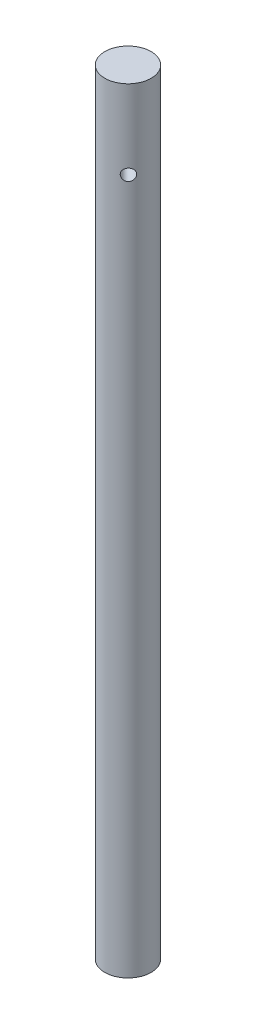
ISO-10303-21;
HEADER;
FILE_DESCRIPTION(('STEP AP214'),'2;1');
FILE_NAME('part.step','',(''),(''),'','','');
FILE_SCHEMA(('AUTOMOTIVE_DESIGN { 1 0 10303 214 1 1 1 1 }'));
ENDSEC;
DATA;
#1=APPLICATION_CONTEXT('core data for automotive mechanical design processes');
#2=APPLICATION_PROTOCOL_DEFINITION('international standard','automotive_design',2000,#1);
#3=PRODUCT_CONTEXT('',#1,'mechanical');
#4=PRODUCT('Part','Part','',(#3));
#5=PRODUCT_RELATED_PRODUCT_CATEGORY('part','',(#4));
#6=PRODUCT_DEFINITION_FORMATION('','',#4);
#7=PRODUCT_DEFINITION_CONTEXT('part definition',#1,'design');
#8=PRODUCT_DEFINITION('design','',#6,#7);
#9=PRODUCT_DEFINITION_SHAPE('','',#8);
#10=(LENGTH_UNIT() NAMED_UNIT(*) SI_UNIT(.MILLI.,.METRE.));
#11=(NAMED_UNIT(*) PLANE_ANGLE_UNIT() SI_UNIT($,.RADIAN.));
#12=(NAMED_UNIT(*) SI_UNIT($,.STERADIAN.) SOLID_ANGLE_UNIT());
#13=UNCERTAINTY_MEASURE_WITH_UNIT(LENGTH_MEASURE(1.E-05),#10,'distance_accuracy_value','');
#14=(GEOMETRIC_REPRESENTATION_CONTEXT(3) GLOBAL_UNCERTAINTY_ASSIGNED_CONTEXT((#13)) GLOBAL_UNIT_ASSIGNED_CONTEXT((#10,
#11,#12)) REPRESENTATION_CONTEXT('',''));
#15=CARTESIAN_POINT('',(0.,0.,0.));
#16=DIRECTION('',(0.,0.,1.));
#17=DIRECTION('',(1.,0.,0.));
#18=AXIS2_PLACEMENT_3D('',#15,#16,#17);
#19=CARTESIAN_POINT('',(0.,100.,0.));
#20=DIRECTION('',(0.,-1.,0.));
#21=DIRECTION('',(0.,0.,-1.));
#22=AXIS2_PLACEMENT_3D('',#19,#20,#21);
#23=CYLINDRICAL_SURFACE('',#22,2.99);
#24=CARTESIAN_POINT('',(-1.55299666851545,89.8183221412136,-2.55505407918892));
#25=CARTESIAN_POINT('',(-1.55299804774372,89.859732546392,-2.55505379055781));
#26=CARTESIAN_POINT('',(-1.5560393059233,89.9011558507691,-2.55321228836767));
#27=CARTESIAN_POINT('',(-1.56804937479956,89.9828125872063,-2.54585330539109));
#28=CARTESIAN_POINT('',(-1.57702161185479,90.0230453174204,-2.54033369972953));
#29=CARTESIAN_POINT('',(-1.60042554352559,90.1011279634517,-2.5256538228311));
#30=CARTESIAN_POINT('',(-1.61485015941354,90.1389808949171,-2.5164982713018));
#31=CARTESIAN_POINT('',(-1.64849051817871,90.2113656455855,-2.494590195497));
#32=CARTESIAN_POINT('',(-1.66770647282616,90.2458973179003,-2.48183751223022));
#33=CARTESIAN_POINT('',(-1.71054697940308,90.311424270247,-2.45251186799045));
#34=CARTESIAN_POINT('',(-1.73425192875563,90.3423351288089,-2.43586768268884));
#35=CARTESIAN_POINT('',(-1.78486048198498,90.3989991477959,-2.39903126565123));
#36=CARTESIAN_POINT('',(-1.81176438605826,90.4247518235569,-2.37883870084291));
#37=CARTESIAN_POINT('',(-1.86815850670153,90.4707141735501,-2.3348188700079));
#38=CARTESIAN_POINT('',(-1.89767975572805,90.4908408655751,-2.31094451299995));
#39=CARTESIAN_POINT('',(-1.95788141249569,90.5244402871537,-2.26016564528618));
#40=CARTESIAN_POINT('',(-1.98856164729927,90.537914005239,-2.23326158547854));
#41=CARTESIAN_POINT('',(-2.04935977395249,90.5575544674233,-2.17758769095947));
#42=CARTESIAN_POINT('',(-2.07947637808587,90.5638645844451,-2.14886707843807));
#43=CARTESIAN_POINT('',(-2.13878946636741,90.5694488136404,-2.08983947732272));
#44=CARTESIAN_POINT('',(-2.167986086779,90.5687239727584,-2.05953272544615));
#45=CARTESIAN_POINT('',(-2.2239661984309,90.560361873068,-1.99893446421197));
#46=CARTESIAN_POINT('',(-2.25078902438457,90.5528793789343,-1.96865773574652));
#47=CARTESIAN_POINT('',(-2.30209545255079,90.5314632005164,-1.90840854431397));
#48=CARTESIAN_POINT('',(-2.32657892969058,90.5175291715348,-1.87843609769172));
#49=CARTESIAN_POINT('',(-2.37295379082373,90.4834805626645,-1.81950824333465));
#50=CARTESIAN_POINT('',(-2.39481961660715,90.4633110054897,-1.79056454319663));
#51=CARTESIAN_POINT('',(-2.43539853428552,90.4174056098257,-1.73496982987379));
#52=CARTESIAN_POINT('',(-2.45411107337477,90.391668797138,-1.70831921909261));
#53=CARTESIAN_POINT('',(-2.48867446433259,90.3345302155224,-1.65757915824247));
#54=CARTESIAN_POINT('',(-2.50443347025009,90.3029932209555,-1.63357925826237));
#55=CARTESIAN_POINT('',(-2.53234566562463,90.2355820326699,-1.58996784657587));
#56=CARTESIAN_POINT('',(-2.54449868422674,90.1997076335544,-1.57035654281592));
#57=CARTESIAN_POINT('',(-2.56520404069773,90.1243871457781,-1.53630373651336));
#58=CARTESIAN_POINT('',(-2.57373840843196,90.084924386884,-1.52188808732345));
#59=CARTESIAN_POINT('',(-2.58709252261702,90.0036987574179,-1.49907601468982));
#60=CARTESIAN_POINT('',(-2.59191307003103,89.9619363848887,-1.49067829338115));
#61=CARTESIAN_POINT('',(-2.5977496230553,89.8784866832829,-1.48048328773453));
#62=CARTESIAN_POINT('',(-2.59886335526589,89.8368268690987,-1.47851648359775));
#63=CARTESIAN_POINT('',(-2.59755764149563,89.7537374897037,-1.48080925592331));
#64=CARTESIAN_POINT('',(-2.59513852318372,89.7123079034971,-1.48506825494763));
#65=CARTESIAN_POINT('',(-2.58684412398161,89.6315606392691,-1.49946787527954));
#66=CARTESIAN_POINT('',(-2.58102651764099,89.5922193962294,-1.50951030859476));
#67=CARTESIAN_POINT('',(-2.56599648247455,89.515982286058,-1.53491972641412));
#68=CARTESIAN_POINT('',(-2.55678364942544,89.4790867107159,-1.55028734490234));
#69=CARTESIAN_POINT('',(-2.53477284551708,89.4079850861229,-1.58602459147858));
#70=CARTESIAN_POINT('',(-2.52190771279183,89.3738464809171,-1.60648694530617));
#71=CARTESIAN_POINT('',(-2.49272402155282,89.309951147698,-1.65140632623785));
#72=CARTESIAN_POINT('',(-2.47640489146903,89.2801951463052,-1.67586401433979));
#73=CARTESIAN_POINT('',(-2.4399635186789,89.225140397684,-1.72850409005155));
#74=CARTESIAN_POINT('',(-2.41975577777871,89.1999729155944,-1.75676482775476));
#75=CARTESIAN_POINT('',(-2.37604329060492,89.1557634029428,-1.81544895312219));
#76=CARTESIAN_POINT('',(-2.35253871669152,89.1367210523268,-1.84587222768683));
#77=CARTESIAN_POINT('',(-2.30280160401133,89.1054682024686,-1.90755375478344));
#78=CARTESIAN_POINT('',(-2.27659041627411,89.0932084523703,-1.93880421387145));
#79=CARTESIAN_POINT('',(-2.22187991756648,89.0757211918924,-2.00126744239292));
#80=CARTESIAN_POINT('',(-2.19338105247952,89.0704923146589,-2.03248021797317));
#81=CARTESIAN_POINT('',(-2.13567430898924,89.0672925455496,-2.09301138470092));
#82=CARTESIAN_POINT('',(-2.10650683653141,89.0691279933491,-2.1223582137819));
#83=CARTESIAN_POINT('',(-2.04761526318508,89.0795609016116,-2.17923097867894));
#84=CARTESIAN_POINT('',(-2.01789117908039,89.0881581585017,-2.20675696928662));
#85=CARTESIAN_POINT('',(-1.95900635580487,89.1117664908891,-2.25919041358641));
#86=CARTESIAN_POINT('',(-1.92984342866874,89.1267423389887,-2.28411132667306));
#87=CARTESIAN_POINT('',(-1.8728802053344,89.1626508118005,-2.33104771329306));
#88=CARTESIAN_POINT('',(-1.84508008243687,89.1835841918094,-2.35306281790934));
#89=CARTESIAN_POINT('',(-1.79115459661245,89.2314029668627,-2.39437839554105));
#90=CARTESIAN_POINT('',(-1.76508571950419,89.2584196102805,-2.41360068750511));
#91=CARTESIAN_POINT('',(-1.7163555050066,89.3173834780057,-2.44849423149075));
#92=CARTESIAN_POINT('',(-1.69369503461555,89.349331952652,-2.46416458051483));
#93=CARTESIAN_POINT('',(-1.65231910717595,89.417976123529,-2.49210313223497));
#94=CARTESIAN_POINT('',(-1.63368589472776,89.4547498268231,-2.50430177844783));
#95=CARTESIAN_POINT('',(-1.60179038352905,89.531545847047,-2.52482272376566));
#96=CARTESIAN_POINT('',(-1.5885241963499,89.5715657867395,-2.5331478299227));
#97=CARTESIAN_POINT('',(-1.56994836073983,89.6459800808891,-2.54469194389663));
#98=CARTESIAN_POINT('',(-1.56361250467652,89.680019929144,-2.54857616210269));
#99=CARTESIAN_POINT('',(-1.55513626128613,89.7488109102885,-2.55375723890201));
#100=CARTESIAN_POINT('',(-1.55299551078238,89.7835619813431,-2.55505432146772));
#101=CARTESIAN_POINT('',(-1.55299666851545,89.8183221412136,-2.55505407918892));
#102=B_SPLINE_CURVE_WITH_KNOTS('',3,(#24,#25,#26,#27,#28,#29,#30,#31,#32,#33,#34,#35,#36,#37,
#38,#39,#40,#41,#42,#43,#44,#45,#46,#47,#48,#49,#50,#51,#52,#53,#54,#55,#56,#57,#58,#59,#60,#61,
#62,#63,#64,#65,#66,#67,#68,#69,#70,#71,#72,#73,#74,#75,#76,#77,#78,#79,#80,#81,#82,#83,#84,#85,
#86,#87,#88,#89,#90,#91,#92,#93,#94,#95,#96,#97,#98,#99,#100,#101),.UNSPECIFIED.,.T.,.F.,(4,2,2,
2,2,2,2,2,2,2,2,2,2,2,2,2,2,2,2,2,2,2,2,2,2,2,2,2,2,2,2,2,2,2,2,2,2,2,4),(0.,0.124103557163027,
0.24827887235225,0.372293523570408,0.496313657028206,0.62281119042198,0.749320603987232,
0.877607866312598,1.00587606134363,1.13152914406381,1.25716352734284,1.37999160921121,
1.50282625438627,1.62677637686661,1.75074820660568,1.87809730233885,2.0054524310238,
2.13343279828125,2.2613855561581,2.38593705644259,2.51047700541285,2.63296242342189,
2.75546242881104,2.88037986896578,3.00531799673551,3.13340553180308,3.26148637287942,
3.38862454001234,3.51573798696387,3.63939191287917,3.76304211617669,3.88601810804661,
4.00900969777712,4.1349644673952,4.26095122220999,4.38930834618167,4.51757230770759,
4.62175464968435,4.7259279720389),.UNSPECIFIED.);
#103=CARTESIAN_POINT('',(-1.55299666851545,89.8183221412136,-2.55505407918892));
#104=VERTEX_POINT('',#103);
#105=EDGE_CURVE('E35',#104,#104,#102,.T.);
#106=ORIENTED_EDGE('',*,*,#105,.T.);
#107=EDGE_LOOP('',(#106));
#108=FACE_BOUND('',#107,.T.);
#109=CARTESIAN_POINT('',(2.59839143379584,89.8183221412136,1.47934511077586));
#110=CARTESIAN_POINT('',(2.59839118469763,89.7769117360352,1.4793464976892));
#111=CARTESIAN_POINT('',(2.59663734643711,89.7354884316581,1.48243913943811));
#112=CARTESIAN_POINT('',(2.58962458781693,89.6538316952208,1.49465460510247));
#113=CARTESIAN_POINT('',(2.58436364136706,89.6135989650068,1.50378091470087));
#114=CARTESIAN_POINT('',(2.57035858794245,89.5355163189755,1.52759480312713));
#115=CARTESIAN_POINT('',(2.5616189964547,89.4976633875101,1.54227517124063));
#116=CARTESIAN_POINT('',(2.54068122866365,89.4252786368416,1.57652787045173));
#117=CARTESIAN_POINT('',(2.52848289948589,89.3907469645269,1.59610041777666));
#118=CARTESIAN_POINT('',(2.50039351078183,89.3252200121801,1.63976148345396));
#119=CARTESIAN_POINT('',(2.48443355358085,89.2943091536183,1.66393240181269));
#120=CARTESIAN_POINT('',(2.44905845167306,89.2376451346312,1.71557298125511));
#121=CARTESIAN_POINT('',(2.42964298260884,89.2118924588703,1.74304295193109));
#122=CARTESIAN_POINT('',(2.38725273832515,89.165930108877,1.8006720204594));
#123=CARTESIAN_POINT('',(2.36423177819014,89.145803416852,1.83086348384049));
#124=CARTESIAN_POINT('',(2.31519406776395,89.1122039952734,1.89249169036978));
#125=CARTESIAN_POINT('',(2.28917776324464,89.0987302771881,1.92392824776549));
#126=CARTESIAN_POINT('',(2.23526407092254,89.0790898150038,1.98629256862013));
#127=CARTESIAN_POINT('',(2.20741584840652,89.0727796979821,2.01721763823734));
#128=CARTESIAN_POINT('',(2.1501073804054,89.0671954687868,2.07819336808366));
#129=CARTESIAN_POINT('',(2.12064737543509,89.0679203096688,2.10824415775574));
#130=CARTESIAN_POINT('',(2.06167364038061,89.0762824093591,2.16593315791079));
#131=CARTESIAN_POINT('',(2.03217580924291,89.0837649034928,2.19361026463969));
#132=CARTESIAN_POINT('',(1.97341743882832,89.1051810819107,2.24661751457472));
#133=CARTESIAN_POINT('',(1.94415691231533,89.1191151108923,2.27194753229205));
#134=CARTESIAN_POINT('',(1.88657840702919,89.1531637197626,2.31998746873311));
#135=CARTESIAN_POINT('',(1.85827140067923,89.1733332769374,2.34267150511057));
#136=CARTESIAN_POINT('',(1.80385904102212,89.2192386726014,2.38482261216534));
#137=CARTESIAN_POINT('',(1.77775407415641,89.2449754852892,2.404289118763));
#138=CARTESIAN_POINT('',(1.72802247498736,89.3021140669047,2.44028842172385));
#139=CARTESIAN_POINT('',(1.70448273146299,89.3336510614716,2.45672685052254));
#140=CARTESIAN_POINT('',(1.66168679483936,89.4010622497573,2.48587395481135));
#141=CARTESIAN_POINT('',(1.64243080471901,89.4369366488728,2.49858245357371));
#142=CARTESIAN_POINT('',(1.60898361546701,89.5122571366491,2.52025250052363));
#143=CARTESIAN_POINT('',(1.5948177455859,89.5517198955432,2.5291953470895));
#144=CARTESIAN_POINT('',(1.57239661827112,89.6329455250093,2.54319592112931));
#145=CARTESIAN_POINT('',(1.56414008639217,89.6747078975384,2.54825448632912));
#146=CARTESIAN_POINT('',(1.55411603921499,89.7581575991443,2.55438000422801));
#147=CARTESIAN_POINT('',(1.55218186614402,89.7998174133284,2.55554948808036));
#148=CARTESIAN_POINT('',(1.55443638790138,89.8829067927234,2.55417878569387));
#149=CARTESIAN_POINT('',(1.5586245148915,89.9243363789301,2.55163894349193));
#150=CARTESIAN_POINT('',(1.57278122018263,90.0050836431581,2.54293642551565));
#151=CARTESIAN_POINT('',(1.58265329879289,90.0444248861978,2.53683420671116));
#152=CARTESIAN_POINT('',(1.60762281670217,90.1206619963692,2.52108417031751));
#153=CARTESIAN_POINT('',(1.62272087817462,90.1575575717113,2.51143593055244));
#154=CARTESIAN_POINT('',(1.65781451319983,90.2286591963042,2.48841283210194));
#155=CARTESIAN_POINT('',(1.67790085529681,90.2627978015101,2.4749681891031));
#156=CARTESIAN_POINT('',(1.72196789067843,90.3266931347291,2.44451272965337));
#157=CARTESIAN_POINT('',(1.74594922835684,90.3564491361219,2.42750132297615));
#158=CARTESIAN_POINT('',(1.79752639819035,90.4115038847432,2.38957050735434));
#159=CARTESIAN_POINT('',(1.82519810510685,90.4366713668327,2.36856339607874));
#160=CARTESIAN_POINT('',(1.8826090651697,90.4808808794844,2.32319171140954));
#161=CARTESIAN_POINT('',(1.9123482101883,90.4999232301004,2.29882731353787));
#162=CARTESIAN_POINT('',(1.97258317851757,90.5311760799586,2.2473478054487));
#163=CARTESIAN_POINT('',(2.00307182172819,90.5434358300569,2.22025426025834));
#164=CARTESIAN_POINT('',(2.06394604484877,90.5609230905347,2.16378105824509));
#165=CARTESIAN_POINT('',(2.09433164364528,90.5661519677683,2.13440184694788));
#166=CARTESIAN_POINT('',(2.15318896862566,90.5693517368776,2.07498883754903));
#167=CARTESIAN_POINT('',(2.18169027583275,90.567516289078,2.04499461620267));
#168=CARTESIAN_POINT('',(2.23685683357891,90.5570833808155,1.98450180915357));
#169=CARTESIAN_POINT('',(2.26352213936688,90.5484861239255,1.95400323866198));
#170=CARTESIAN_POINT('',(2.31425138253551,90.524877791538,1.89364404399483));
#171=CARTESIAN_POINT('',(2.33832871128682,90.5099019434385,1.86378084811059));
#172=CARTESIAN_POINT('',(2.38361805658679,90.4739934706266,1.80549956120063));
#173=CARTESIAN_POINT('',(2.40482970932156,90.4530600906177,1.77708165394758));
#174=CARTESIAN_POINT('',(2.44458735250503,90.4052413155645,1.72199749302143));
#175=CARTESIAN_POINT('',(2.46305680806162,90.3782246721466,1.69538993632264));
#176=CARTESIAN_POINT('',(2.49654350881819,90.3192608044215,1.64568245107848));
#177=CARTESIAN_POINT('',(2.5115598761662,90.2873123297752,1.6225834149828));
#178=CARTESIAN_POINT('',(2.53830459300746,90.2186681588982,1.58042597003192));
#179=CARTESIAN_POINT('',(2.54996576477813,90.1818944556041,1.56145175994294));
#180=CARTESIAN_POINT('',(2.56956683214982,90.1050984353801,1.52898283650443));
#181=CARTESIAN_POINT('',(2.57750942253453,90.0650784956877,1.51548415609562));
#182=CARTESIAN_POINT('',(2.58851796908361,89.9906642015381,1.49658600436239));
#183=CARTESIAN_POINT('',(2.59221953741285,89.9566243532831,1.49014173442459));
#184=CARTESIAN_POINT('',(2.59715626756516,89.8878333721387,1.48152089025381));
#185=CARTESIAN_POINT('',(2.59839164289047,89.853082301084,1.47934394659189));
#186=CARTESIAN_POINT('',(2.59839143379584,89.8183221412136,1.47934511077586));
#187=B_SPLINE_CURVE_WITH_KNOTS('',3,(#109,#110,#111,#112,#113,#114,#115,#116,#117,#118,#119,
#120,#121,#122,#123,#124,#125,#126,#127,#128,#129,#130,#131,#132,#133,#134,#135,#136,#137,#138,
#139,#140,#141,#142,#143,#144,#145,#146,#147,#148,#149,#150,#151,#152,#153,#154,#155,#156,#157,
#158,#159,#160,#161,#162,#163,#164,#165,#166,#167,#168,#169,#170,#171,#172,#173,#174,#175,#176,
#177,#178,#179,#180,#181,#182,#183,#184,#185,#186),.UNSPECIFIED.,.T.,.F.,(4,2,2,2,2,2,2,2,2,2,2,
2,2,2,2,2,2,2,2,2,2,2,2,2,2,2,2,2,2,2,2,2,2,2,2,2,2,2,4),(0.,0.124103557163027,
0.248278872352249,0.372293523570393,0.496313657028206,0.62281119042198,0.749320603987232,
0.877607866312608,1.00587606134363,1.13152914406381,1.25716352734284,1.37999160921121,
1.50282625438627,1.62677637686661,1.75074820660569,1.87809730233885,2.0054524310238,
2.13343279828125,2.2613855561581,2.3859370564426,2.51047700541285,2.63296242342189,
2.75546242881104,2.88037986896577,3.00531799673551,3.13340553180308,3.26148637287942,
3.38862454001234,3.51573798696388,3.63939191287917,3.76304211617669,3.88601810804661,
4.00900969777712,4.13496446739518,4.26095122220997,4.38930834618163,4.51757230770759,
4.62175464968435,4.7259279720389),.UNSPECIFIED.);
#188=CARTESIAN_POINT('',(2.59839143379584,89.8183221412136,1.47934511077586));
#189=VERTEX_POINT('',#188);
#190=EDGE_CURVE('E10',#189,#189,#187,.T.);
#191=ORIENTED_EDGE('',*,*,#190,.T.);
#192=EDGE_LOOP('',(#191));
#193=FACE_BOUND('',#192,.T.);
#194=CARTESIAN_POINT('',(0.,100.,0.));
#195=DIRECTION('',(0.,1.,0.));
#196=DIRECTION('',(0.,0.,1.));
#197=AXIS2_PLACEMENT_3D('',#194,#195,#196);
#198=CIRCLE('',#197,2.99);
#199=CARTESIAN_POINT('',(0.,100.,2.99));
#200=VERTEX_POINT('',#199);
#201=EDGE_CURVE('E42',#200,#200,#198,.T.);
#202=ORIENTED_EDGE('',*,*,#201,.F.);
#203=EDGE_LOOP('',(#202));
#204=FACE_BOUND('',#203,.T.);
#205=CARTESIAN_POINT('',(0.,0.,0.));
#206=DIRECTION('',(0.,1.,0.));
#207=DIRECTION('',(0.,0.,1.));
#208=AXIS2_PLACEMENT_3D('',#205,#206,#207);
#209=CIRCLE('',#208,2.99);
#210=CARTESIAN_POINT('',(0.,0.,2.99));
#211=VERTEX_POINT('',#210);
#212=EDGE_CURVE('E46',#211,#211,#209,.T.);
#213=ORIENTED_EDGE('',*,*,#212,.T.);
#214=EDGE_LOOP('',(#213));
#215=FACE_BOUND('',#214,.T.);
#216=ADVANCED_FACE('F31',(#108,#193,#204,#215),#23,.T.);
#217=CARTESIAN_POINT('',(0.,100.,0.));
#218=DIRECTION('',(0.,1.,0.));
#219=DIRECTION('',(0.,0.,1.));
#220=AXIS2_PLACEMENT_3D('',#217,#218,#219);
#221=PLANE('',#220);
#222=ORIENTED_EDGE('',*,*,#201,.T.);
#223=EDGE_LOOP('',(#222));
#224=FACE_BOUND('',#223,.T.);
#225=ADVANCED_FACE('F57',(#224),#221,.T.);
#226=CARTESIAN_POINT('',(0.,0.,0.));
#227=DIRECTION('',(0.,1.,0.));
#228=DIRECTION('',(0.,0.,1.));
#229=AXIS2_PLACEMENT_3D('',#226,#227,#228);
#230=PLANE('',#229);
#231=ORIENTED_EDGE('',*,*,#212,.F.);
#232=EDGE_LOOP('',(#231));
#233=FACE_BOUND('',#232,.T.);
#234=ADVANCED_FACE('F55',(#233),#230,.F.);
#235=CARTESIAN_POINT('',(2.1442465437034,89.8183221412136,2.0838202321256));
#236=DIRECTION('',(0.717139312275386,0.,0.696929843520269));
#237=DIRECTION('',(0.696929843520269,0.,-0.717139312275386));
#238=AXIS2_PLACEMENT_3D('',#235,#236,#237);
#239=CYLINDRICAL_SURFACE('',#238,0.749999999999987);
#240=ORIENTED_EDGE('',*,*,#190,.F.);
#241=EDGE_LOOP('',(#240));
#242=FACE_BOUND('',#241,.T.);
#243=ORIENTED_EDGE('',*,*,#105,.F.);
#244=EDGE_LOOP('',(#243));
#245=FACE_BOUND('',#244,.T.);
#246=ADVANCED_FACE('F51',(#242,#245),#239,.F.);
#247=CLOSED_SHELL('',(#216,#225,#234,#246));
#248=MANIFOLD_SOLID_BREP('B2',#247);
#249=ADVANCED_BREP_SHAPE_REPRESENTATION('',(#18,#248),#14);
#250=SHAPE_DEFINITION_REPRESENTATION(#9,#249);
ENDSEC;
END-ISO-10303-21;
